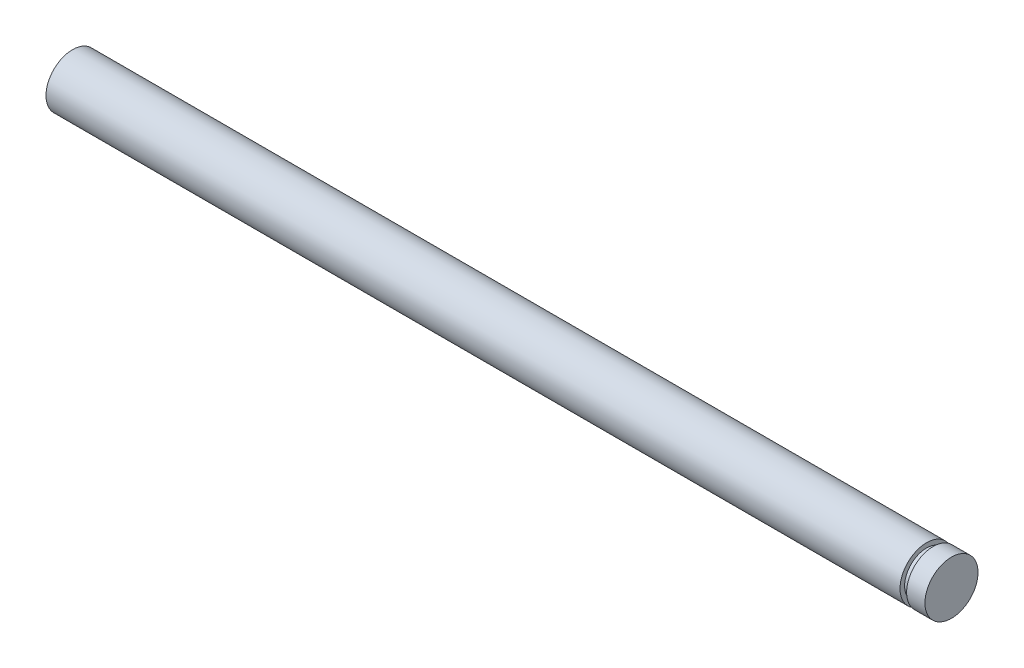
ISO-10303-21;
HEADER;
FILE_DESCRIPTION(('STEP AP214'),'2;1');
FILE_NAME('part.step','',(''),(''),'','','');
FILE_SCHEMA(('AUTOMOTIVE_DESIGN { 1 0 10303 214 1 1 1 1 }'));
ENDSEC;
DATA;
#1=APPLICATION_CONTEXT('core data for automotive mechanical design processes');
#2=APPLICATION_PROTOCOL_DEFINITION('international standard','automotive_design',2000,#1);
#3=PRODUCT_CONTEXT('',#1,'mechanical');
#4=PRODUCT('Part','Part','',(#3));
#5=PRODUCT_RELATED_PRODUCT_CATEGORY('part','',(#4));
#6=PRODUCT_DEFINITION_FORMATION('','',#4);
#7=PRODUCT_DEFINITION_CONTEXT('part definition',#1,'design');
#8=PRODUCT_DEFINITION('design','',#6,#7);
#9=PRODUCT_DEFINITION_SHAPE('','',#8);
#10=(LENGTH_UNIT() NAMED_UNIT(*) SI_UNIT(.MILLI.,.METRE.));
#11=(NAMED_UNIT(*) PLANE_ANGLE_UNIT() SI_UNIT($,.RADIAN.));
#12=(NAMED_UNIT(*) SI_UNIT($,.STERADIAN.) SOLID_ANGLE_UNIT());
#13=UNCERTAINTY_MEASURE_WITH_UNIT(LENGTH_MEASURE(1.E-05),#10,'distance_accuracy_value','');
#14=(GEOMETRIC_REPRESENTATION_CONTEXT(3) GLOBAL_UNCERTAINTY_ASSIGNED_CONTEXT((#13)) GLOBAL_UNIT_ASSIGNED_CONTEXT((#10,
#11,#12)) REPRESENTATION_CONTEXT('',''));
#15=CARTESIAN_POINT('',(0.,0.,0.));
#16=DIRECTION('',(0.,0.,1.));
#17=DIRECTION('',(1.,0.,0.));
#18=AXIS2_PLACEMENT_3D('',#15,#16,#17);
#19=CARTESIAN_POINT('',(0.,0.,0.));
#20=DIRECTION('',(-1.,0.,0.));
#21=DIRECTION('',(0.,-1.,0.));
#22=AXIS2_PLACEMENT_3D('',#19,#20,#21);
#23=PLANE('',#22);
#24=CARTESIAN_POINT('',(0.,0.,0.));
#25=DIRECTION('',(1.,0.,0.));
#26=DIRECTION('',(0.,1.,0.));
#27=AXIS2_PLACEMENT_3D('',#24,#25,#26);
#28=CIRCLE('',#27,0.725);
#29=CARTESIAN_POINT('',(0.,0.725,0.));
#30=VERTEX_POINT('',#29);
#31=EDGE_CURVE('E10',#30,#30,#28,.T.);
#32=ORIENTED_EDGE('',*,*,#31,.F.);
#33=EDGE_LOOP('',(#32));
#34=FACE_BOUND('',#33,.T.);
#35=ADVANCED_FACE('F34',(#34),#23,.T.);
#36=CARTESIAN_POINT('',(24.,0.,0.));
#37=DIRECTION('',(1.,0.,0.));
#38=DIRECTION('',(0.,1.,0.));
#39=AXIS2_PLACEMENT_3D('',#36,#37,#38);
#40=CYLINDRICAL_SURFACE('',#39,0.724999999999999);
#41=ORIENTED_EDGE('',*,*,#31,.T.);
#42=EDGE_LOOP('',(#41));
#43=FACE_BOUND('',#42,.T.);
#44=CARTESIAN_POINT('',(23.32,0.,0.));
#45=DIRECTION('',(1.,0.,0.));
#46=DIRECTION('',(0.,1.,0.));
#47=AXIS2_PLACEMENT_3D('',#44,#45,#46);
#48=CIRCLE('',#47,0.724999999999998);
#49=CARTESIAN_POINT('',(23.32,0.725,0.));
#50=VERTEX_POINT('',#49);
#51=EDGE_CURVE('E40',#50,#50,#48,.T.);
#52=ORIENTED_EDGE('',*,*,#51,.F.);
#53=EDGE_LOOP('',(#52));
#54=FACE_BOUND('',#53,.T.);
#55=ADVANCED_FACE('F76',(#43,#54),#40,.T.);
#56=CARTESIAN_POINT('',(23.32,0.725,0.));
#57=DIRECTION('',(1.,0.,0.));
#58=DIRECTION('',(0.,1.,0.));
#59=AXIS2_PLACEMENT_3D('',#56,#57,#58);
#60=PLANE('',#59);
#61=ORIENTED_EDGE('',*,*,#51,.T.);
#62=EDGE_LOOP('',(#61));
#63=FACE_BOUND('',#62,.T.);
#64=CARTESIAN_POINT('',(23.32,0.,0.));
#65=DIRECTION('',(1.,0.,0.));
#66=DIRECTION('',(0.,1.,0.));
#67=AXIS2_PLACEMENT_3D('',#64,#65,#66);
#68=CIRCLE('',#67,0.599999999999998);
#69=CARTESIAN_POINT('',(23.32,0.6,0.));
#70=VERTEX_POINT('',#69);
#71=EDGE_CURVE('E44',#70,#70,#68,.T.);
#72=ORIENTED_EDGE('',*,*,#71,.F.);
#73=EDGE_LOOP('',(#72));
#74=FACE_BOUND('',#73,.T.);
#75=ADVANCED_FACE('F81',(#63,#74),#60,.T.);
#76=CARTESIAN_POINT('',(24.,0.,0.));
#77=DIRECTION('',(1.,0.,0.));
#78=DIRECTION('',(0.,1.,0.));
#79=AXIS2_PLACEMENT_3D('',#76,#77,#78);
#80=CYLINDRICAL_SURFACE('',#79,0.599999999999998);
#81=ORIENTED_EDGE('',*,*,#71,.T.);
#82=EDGE_LOOP('',(#81));
#83=FACE_BOUND('',#82,.T.);
#84=CARTESIAN_POINT('',(23.5,0.,0.));
#85=DIRECTION('',(1.,0.,0.));
#86=DIRECTION('',(0.,1.,0.));
#87=AXIS2_PLACEMENT_3D('',#84,#85,#86);
#88=CIRCLE('',#87,0.599999999999998);
#89=CARTESIAN_POINT('',(23.5,0.6,0.));
#90=VERTEX_POINT('',#89);
#91=EDGE_CURVE('E48',#90,#90,#88,.T.);
#92=ORIENTED_EDGE('',*,*,#91,.F.);
#93=EDGE_LOOP('',(#92));
#94=FACE_BOUND('',#93,.T.);
#95=ADVANCED_FACE('F72',(#83,#94),#80,.T.);
#96=CARTESIAN_POINT('',(23.5,0.6,0.));
#97=DIRECTION('',(-1.,0.,0.));
#98=DIRECTION('',(0.,-1.,0.));
#99=AXIS2_PLACEMENT_3D('',#96,#97,#98);
#100=PLANE('',#99);
#101=ORIENTED_EDGE('',*,*,#91,.T.);
#102=EDGE_LOOP('',(#101));
#103=FACE_BOUND('',#102,.T.);
#104=CARTESIAN_POINT('',(23.5,0.,0.));
#105=DIRECTION('',(1.,0.,0.));
#106=DIRECTION('',(0.,1.,0.));
#107=AXIS2_PLACEMENT_3D('',#104,#105,#106);
#108=CIRCLE('',#107,0.724999999999998);
#109=CARTESIAN_POINT('',(23.5,0.725,0.));
#110=VERTEX_POINT('',#109);
#111=EDGE_CURVE('E53',#110,#110,#108,.T.);
#112=ORIENTED_EDGE('',*,*,#111,.F.);
#113=EDGE_LOOP('',(#112));
#114=FACE_BOUND('',#113,.T.);
#115=ADVANCED_FACE('F64',(#103,#114),#100,.T.);
#116=CARTESIAN_POINT('',(24.,0.,0.));
#117=DIRECTION('',(1.,0.,0.));
#118=DIRECTION('',(0.,1.,0.));
#119=AXIS2_PLACEMENT_3D('',#116,#117,#118);
#120=CYLINDRICAL_SURFACE('',#119,0.724999999999998);
#121=ORIENTED_EDGE('',*,*,#111,.T.);
#122=EDGE_LOOP('',(#121));
#123=FACE_BOUND('',#122,.T.);
#124=CARTESIAN_POINT('',(24.,0.,0.));
#125=DIRECTION('',(1.,0.,0.));
#126=DIRECTION('',(0.,1.,0.));
#127=AXIS2_PLACEMENT_3D('',#124,#125,#126);
#128=CIRCLE('',#127,0.724999999999998);
#129=CARTESIAN_POINT('',(24.,0.725,0.));
#130=VERTEX_POINT('',#129);
#131=EDGE_CURVE('E56',#130,#130,#128,.T.);
#132=ORIENTED_EDGE('',*,*,#131,.F.);
#133=EDGE_LOOP('',(#132));
#134=FACE_BOUND('',#133,.T.);
#135=ADVANCED_FACE('F62',(#123,#134),#120,.T.);
#136=CARTESIAN_POINT('',(24.,0.725,0.));
#137=DIRECTION('',(1.,0.,0.));
#138=DIRECTION('',(0.,1.,0.));
#139=AXIS2_PLACEMENT_3D('',#136,#137,#138);
#140=PLANE('',#139);
#141=ORIENTED_EDGE('',*,*,#131,.T.);
#142=EDGE_LOOP('',(#141));
#143=FACE_BOUND('',#142,.T.);
#144=ADVANCED_FACE('F60',(#143),#140,.T.);
#145=CLOSED_SHELL('',(#35,#55,#75,#95,#115,#135,#144));
#146=MANIFOLD_SOLID_BREP('B2',#145);
#147=ADVANCED_BREP_SHAPE_REPRESENTATION('',(#18,#146),#14);
#148=SHAPE_DEFINITION_REPRESENTATION(#9,#147);
ENDSEC;
END-ISO-10303-21;
